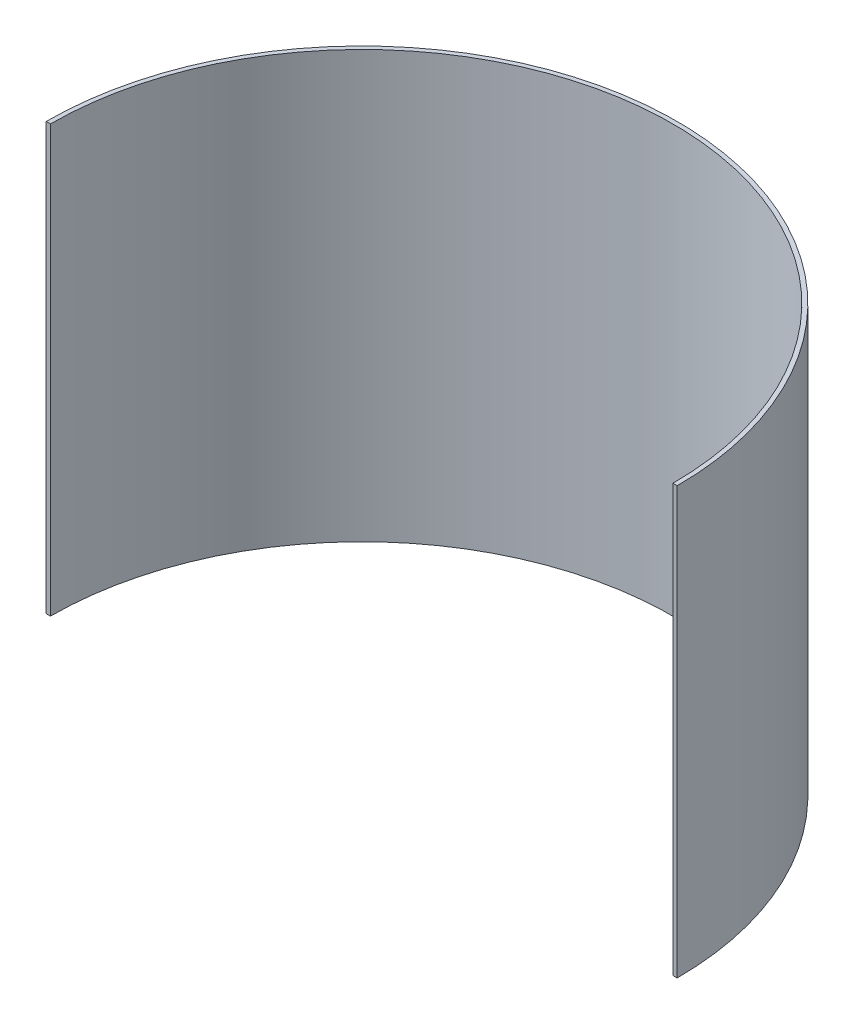
ISO-10303-21;
HEADER;
FILE_DESCRIPTION(('STEP AP214'),'2;1');
FILE_NAME('part.step','',(''),(''),'','','');
FILE_SCHEMA(('AUTOMOTIVE_DESIGN { 1 0 10303 214 1 1 1 1 }'));
ENDSEC;
DATA;
#1=APPLICATION_CONTEXT('core data for automotive mechanical design processes');
#2=APPLICATION_PROTOCOL_DEFINITION('international standard','automotive_design',2000,#1);
#3=PRODUCT_CONTEXT('',#1,'mechanical');
#4=PRODUCT('Part','Part','',(#3));
#5=PRODUCT_RELATED_PRODUCT_CATEGORY('part','',(#4));
#6=PRODUCT_DEFINITION_FORMATION('','',#4);
#7=PRODUCT_DEFINITION_CONTEXT('part definition',#1,'design');
#8=PRODUCT_DEFINITION('design','',#6,#7);
#9=PRODUCT_DEFINITION_SHAPE('','',#8);
#10=(LENGTH_UNIT() NAMED_UNIT(*) SI_UNIT(.MILLI.,.METRE.));
#11=(NAMED_UNIT(*) PLANE_ANGLE_UNIT() SI_UNIT($,.RADIAN.));
#12=(NAMED_UNIT(*) SI_UNIT($,.STERADIAN.) SOLID_ANGLE_UNIT());
#13=UNCERTAINTY_MEASURE_WITH_UNIT(LENGTH_MEASURE(1.E-05),#10,'distance_accuracy_value','');
#14=(GEOMETRIC_REPRESENTATION_CONTEXT(3) GLOBAL_UNCERTAINTY_ASSIGNED_CONTEXT((#13)) GLOBAL_UNIT_ASSIGNED_CONTEXT((#10,
#11,#12)) REPRESENTATION_CONTEXT('',''));
#15=CARTESIAN_POINT('',(0.,0.,0.));
#16=DIRECTION('',(0.,0.,1.));
#17=DIRECTION('',(1.,0.,0.));
#18=AXIS2_PLACEMENT_3D('',#15,#16,#17);
#19=CARTESIAN_POINT('',(0.,50.,0.));
#20=DIRECTION('',(0.,1.,0.));
#21=DIRECTION('',(0.,0.,1.));
#22=AXIS2_PLACEMENT_3D('',#19,#20,#21);
#23=PLANE('',#22);
#24=CARTESIAN_POINT('',(0.,50.,0.));
#25=DIRECTION('',(0.,1.,0.));
#26=DIRECTION('',(0.,0.,1.));
#27=AXIS2_PLACEMENT_3D('',#24,#25,#26);
#28=CIRCLE('',#27,37.);
#29=CARTESIAN_POINT('',(37.,50.,0.));
#30=VERTEX_POINT('',#29);
#31=CARTESIAN_POINT('',(-37.,50.,0.));
#32=VERTEX_POINT('',#31);
#33=EDGE_CURVE('E94',#30,#32,#28,.T.);
#34=ORIENTED_EDGE('',*,*,#33,.T.);
#35=DIRECTION('',(-1.,0.,0.));
#36=VECTOR('',#35,1.);
#37=CARTESIAN_POINT('',(37.,50.,0.));
#38=LINE('',#37,#36);
#39=CARTESIAN_POINT('',(-36.5,50.,0.));
#40=VERTEX_POINT('',#39);
#41=EDGE_CURVE('E97',#40,#32,#38,.T.);
#42=ORIENTED_EDGE('',*,*,#41,.F.);
#43=CARTESIAN_POINT('',(0.,50.,0.));
#44=DIRECTION('',(0.,1.,0.));
#45=DIRECTION('',(0.,0.,1.));
#46=AXIS2_PLACEMENT_3D('',#43,#44,#45);
#47=CIRCLE('',#46,36.5);
#48=CARTESIAN_POINT('',(36.5,50.,0.));
#49=VERTEX_POINT('',#48);
#50=EDGE_CURVE('E96',#49,#40,#47,.T.);
#51=ORIENTED_EDGE('',*,*,#50,.F.);
#52=EDGE_CURVE('E63',#30,#49,#38,.T.);
#53=ORIENTED_EDGE('',*,*,#52,.F.);
#54=EDGE_LOOP('',(#34,#42,#51,#53));
#55=FACE_BOUND('',#54,.T.);
#56=ADVANCED_FACE('F41',(#55),#23,.T.);
#57=CARTESIAN_POINT('',(0.,0.,0.));
#58=DIRECTION('',(0.,1.,0.));
#59=DIRECTION('',(0.,0.,1.));
#60=AXIS2_PLACEMENT_3D('',#57,#58,#59);
#61=PLANE('',#60);
#62=DIRECTION('',(-1.,0.,0.));
#63=VECTOR('',#62,1.);
#64=CARTESIAN_POINT('',(37.,0.,0.));
#65=LINE('',#64,#63);
#66=CARTESIAN_POINT('',(-36.5,0.,0.));
#67=VERTEX_POINT('',#66);
#68=CARTESIAN_POINT('',(-37.,0.,0.));
#69=VERTEX_POINT('',#68);
#70=EDGE_CURVE('E56',#67,#69,#65,.T.);
#71=ORIENTED_EDGE('',*,*,#70,.T.);
#72=CARTESIAN_POINT('',(0.,0.,0.));
#73=DIRECTION('',(0.,1.,0.));
#74=DIRECTION('',(0.,0.,1.));
#75=AXIS2_PLACEMENT_3D('',#72,#73,#74);
#76=CIRCLE('',#75,37.);
#77=CARTESIAN_POINT('',(37.,0.,0.));
#78=VERTEX_POINT('',#77);
#79=EDGE_CURVE('E100',#78,#69,#76,.T.);
#80=ORIENTED_EDGE('',*,*,#79,.F.);
#81=CARTESIAN_POINT('',(36.5,0.,0.));
#82=VERTEX_POINT('',#81);
#83=EDGE_CURVE('E82',#78,#82,#65,.T.);
#84=ORIENTED_EDGE('',*,*,#83,.T.);
#85=CARTESIAN_POINT('',(0.,0.,0.));
#86=DIRECTION('',(0.,1.,0.));
#87=DIRECTION('',(0.,0.,1.));
#88=AXIS2_PLACEMENT_3D('',#85,#86,#87);
#89=CIRCLE('',#88,36.5);
#90=EDGE_CURVE('E87',#82,#67,#89,.T.);
#91=ORIENTED_EDGE('',*,*,#90,.T.);
#92=EDGE_LOOP('',(#71,#80,#84,#91));
#93=FACE_BOUND('',#92,.T.);
#94=ADVANCED_FACE('F110',(#93),#61,.F.);
#95=CARTESIAN_POINT('',(0.,50.,0.));
#96=DIRECTION('',(0.,-1.,0.));
#97=DIRECTION('',(0.,0.,-1.));
#98=AXIS2_PLACEMENT_3D('',#95,#96,#97);
#99=CYLINDRICAL_SURFACE('',#98,37.);
#100=DIRECTION('',(0.,-1.,0.));
#101=VECTOR('',#100,1.);
#102=CARTESIAN_POINT('',(-37.,50.,0.));
#103=LINE('',#102,#101);
#104=EDGE_CURVE('E88',#32,#69,#103,.T.);
#105=ORIENTED_EDGE('',*,*,#104,.F.);
#106=ORIENTED_EDGE('',*,*,#33,.F.);
#107=DIRECTION('',(0.,-1.,0.));
#108=VECTOR('',#107,1.);
#109=CARTESIAN_POINT('',(37.,50.,0.));
#110=LINE('',#109,#108);
#111=EDGE_CURVE('E79',#30,#78,#110,.T.);
#112=ORIENTED_EDGE('',*,*,#111,.T.);
#113=ORIENTED_EDGE('',*,*,#79,.T.);
#114=EDGE_LOOP('',(#105,#106,#112,#113));
#115=FACE_BOUND('',#114,.T.);
#116=ADVANCED_FACE('F43',(#115),#99,.T.);
#117=CARTESIAN_POINT('',(0.,50.,0.));
#118=DIRECTION('',(0.,-1.,0.));
#119=DIRECTION('',(0.,0.,-1.));
#120=AXIS2_PLACEMENT_3D('',#117,#118,#119);
#121=CYLINDRICAL_SURFACE('',#120,36.5);
#122=ORIENTED_EDGE('',*,*,#50,.T.);
#123=DIRECTION('',(0.,-1.,0.));
#124=VECTOR('',#123,1.);
#125=CARTESIAN_POINT('',(-36.5,50.,0.));
#126=LINE('',#125,#124);
#127=EDGE_CURVE('E11',#40,#67,#126,.T.);
#128=ORIENTED_EDGE('',*,*,#127,.T.);
#129=ORIENTED_EDGE('',*,*,#90,.F.);
#130=DIRECTION('',(0.,-1.,0.));
#131=VECTOR('',#130,1.);
#132=CARTESIAN_POINT('',(36.5,50.,0.));
#133=LINE('',#132,#131);
#134=EDGE_CURVE('E49',#82,#49,#133,.F.);
#135=ORIENTED_EDGE('',*,*,#134,.T.);
#136=EDGE_LOOP('',(#122,#128,#129,#135));
#137=FACE_BOUND('',#136,.T.);
#138=ADVANCED_FACE('F112',(#137),#121,.F.);
#139=CARTESIAN_POINT('',(37.,50.,0.));
#140=DIRECTION('',(0.,0.,1.));
#141=DIRECTION('',(1.,0.,0.));
#142=AXIS2_PLACEMENT_3D('',#139,#140,#141);
#143=PLANE('',#142);
#144=ORIENTED_EDGE('',*,*,#83,.F.);
#145=ORIENTED_EDGE('',*,*,#111,.F.);
#146=ORIENTED_EDGE('',*,*,#52,.T.);
#147=ORIENTED_EDGE('',*,*,#134,.F.);
#148=EDGE_LOOP('',(#144,#145,#146,#147));
#149=FACE_BOUND('',#148,.T.);
#150=ADVANCED_FACE('F80',(#149),#143,.T.);
#151=ORIENTED_EDGE('',*,*,#41,.T.);
#152=ORIENTED_EDGE('',*,*,#104,.T.);
#153=ORIENTED_EDGE('',*,*,#70,.F.);
#154=ORIENTED_EDGE('',*,*,#127,.F.);
#155=EDGE_LOOP('',(#151,#152,#153,#154));
#156=FACE_BOUND('',#155,.T.);
#157=ADVANCED_FACE('F113',(#156),#143,.T.);
#158=CLOSED_SHELL('',(#56,#94,#116,#138,#150,#157));
#159=MANIFOLD_SOLID_BREP('B2',#158);
#160=ADVANCED_BREP_SHAPE_REPRESENTATION('',(#18,#159),#14);
#161=SHAPE_DEFINITION_REPRESENTATION(#9,#160);
ENDSEC;
END-ISO-10303-21;
